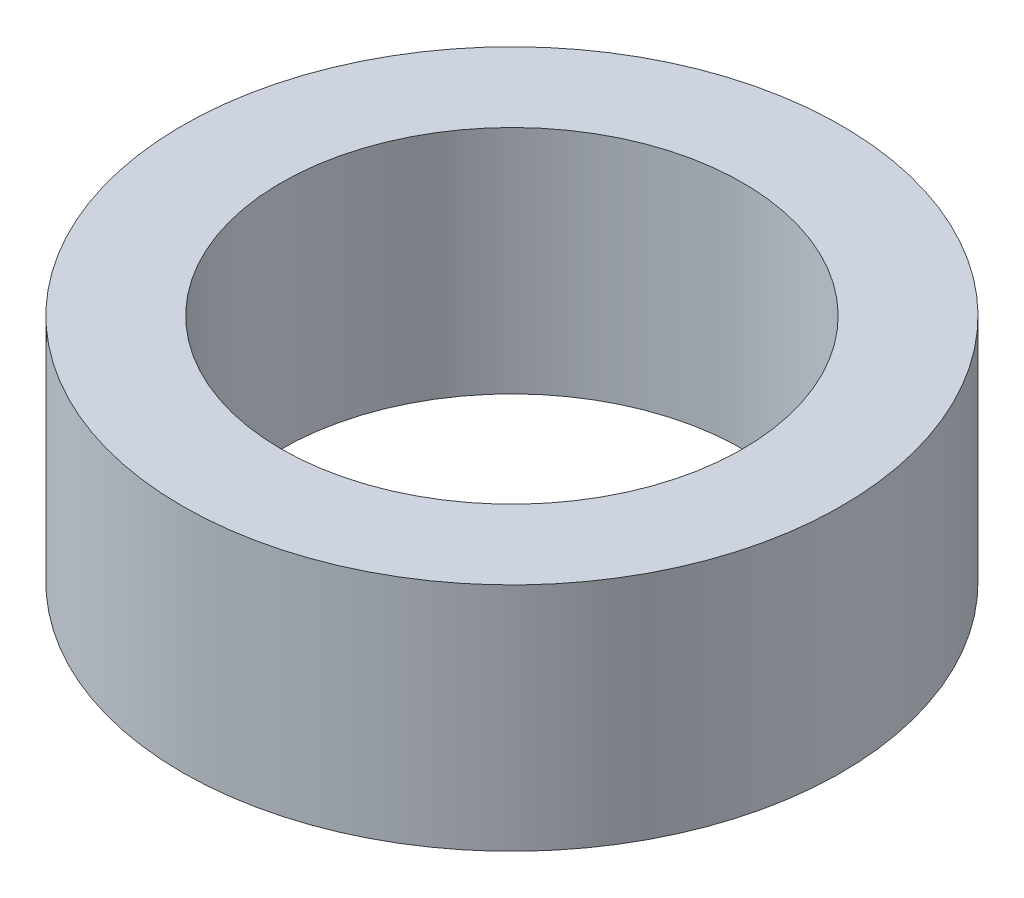
ISO-10303-21;
HEADER;
FILE_DESCRIPTION(('STEP AP214'),'2;1');
FILE_NAME('part.step','',(''),(''),'','','');
FILE_SCHEMA(('AUTOMOTIVE_DESIGN { 1 0 10303 214 1 1 1 1 }'));
ENDSEC;
DATA;
#1=APPLICATION_CONTEXT('core data for automotive mechanical design processes');
#2=APPLICATION_PROTOCOL_DEFINITION('international standard','automotive_design',2000,#1);
#3=PRODUCT_CONTEXT('',#1,'mechanical');
#4=PRODUCT('Part','Part','',(#3));
#5=PRODUCT_RELATED_PRODUCT_CATEGORY('part','',(#4));
#6=PRODUCT_DEFINITION_FORMATION('','',#4);
#7=PRODUCT_DEFINITION_CONTEXT('part definition',#1,'design');
#8=PRODUCT_DEFINITION('design','',#6,#7);
#9=PRODUCT_DEFINITION_SHAPE('','',#8);
#10=(LENGTH_UNIT() NAMED_UNIT(*) SI_UNIT(.MILLI.,.METRE.));
#11=(NAMED_UNIT(*) PLANE_ANGLE_UNIT() SI_UNIT($,.RADIAN.));
#12=(NAMED_UNIT(*) SI_UNIT($,.STERADIAN.) SOLID_ANGLE_UNIT());
#13=UNCERTAINTY_MEASURE_WITH_UNIT(LENGTH_MEASURE(1.E-05),#10,'distance_accuracy_value','');
#14=(GEOMETRIC_REPRESENTATION_CONTEXT(3) GLOBAL_UNCERTAINTY_ASSIGNED_CONTEXT((#13)) GLOBAL_UNIT_ASSIGNED_CONTEXT((#10,
#11,#12)) REPRESENTATION_CONTEXT('',''));
#15=CARTESIAN_POINT('',(0.,0.,0.));
#16=DIRECTION('',(0.,0.,1.));
#17=DIRECTION('',(1.,0.,0.));
#18=AXIS2_PLACEMENT_3D('',#15,#16,#17);
#19=CARTESIAN_POINT('',(0.,8.89,0.));
#20=DIRECTION('',(0.,1.,0.));
#21=DIRECTION('',(0.,0.,1.));
#22=AXIS2_PLACEMENT_3D('',#19,#20,#21);
#23=PLANE('',#22);
#24=CARTESIAN_POINT('',(0.,8.89,0.));
#25=DIRECTION('',(0.,1.,0.));
#26=DIRECTION('',(0.,0.,1.));
#27=AXIS2_PLACEMENT_3D('',#24,#25,#26);
#28=CIRCLE('',#27,12.7);
#29=CARTESIAN_POINT('',(0.,8.89,12.7));
#30=VERTEX_POINT('',#29);
#31=EDGE_CURVE('E10',#30,#30,#28,.T.);
#32=ORIENTED_EDGE('',*,*,#31,.T.);
#33=EDGE_LOOP('',(#32));
#34=FACE_BOUND('',#33,.T.);
#35=CARTESIAN_POINT('',(0.,8.89,0.));
#36=DIRECTION('',(0.,1.,0.));
#37=DIRECTION('',(0.,0.,1.));
#38=AXIS2_PLACEMENT_3D('',#35,#36,#37);
#39=CIRCLE('',#38,8.89);
#40=CARTESIAN_POINT('',(0.,8.89,8.89));
#41=VERTEX_POINT('',#40);
#42=EDGE_CURVE('E54',#41,#41,#39,.T.);
#43=ORIENTED_EDGE('',*,*,#42,.F.);
#44=EDGE_LOOP('',(#43));
#45=FACE_BOUND('',#44,.T.);
#46=ADVANCED_FACE('F41',(#34,#45),#23,.T.);
#47=CARTESIAN_POINT('',(0.,0.,0.));
#48=DIRECTION('',(0.,1.,0.));
#49=DIRECTION('',(0.,0.,1.));
#50=AXIS2_PLACEMENT_3D('',#47,#48,#49);
#51=PLANE('',#50);
#52=CARTESIAN_POINT('',(0.,0.,0.));
#53=DIRECTION('',(0.,1.,0.));
#54=DIRECTION('',(0.,0.,1.));
#55=AXIS2_PLACEMENT_3D('',#52,#53,#54);
#56=CIRCLE('',#55,12.7);
#57=CARTESIAN_POINT('',(0.,0.,12.7));
#58=VERTEX_POINT('',#57);
#59=EDGE_CURVE('E45',#58,#58,#56,.T.);
#60=ORIENTED_EDGE('',*,*,#59,.F.);
#61=EDGE_LOOP('',(#60));
#62=FACE_BOUND('',#61,.T.);
#63=CARTESIAN_POINT('',(0.,0.,0.));
#64=DIRECTION('',(0.,1.,0.));
#65=DIRECTION('',(0.,0.,1.));
#66=AXIS2_PLACEMENT_3D('',#63,#64,#65);
#67=CIRCLE('',#66,8.89);
#68=CARTESIAN_POINT('',(0.,0.,8.89));
#69=VERTEX_POINT('',#68);
#70=EDGE_CURVE('E56',#69,#69,#67,.T.);
#71=ORIENTED_EDGE('',*,*,#70,.T.);
#72=EDGE_LOOP('',(#71));
#73=FACE_BOUND('',#72,.T.);
#74=ADVANCED_FACE('F68',(#62,#73),#51,.F.);
#75=CARTESIAN_POINT('',(0.,8.89,0.));
#76=DIRECTION('',(0.,-1.,0.));
#77=DIRECTION('',(0.,0.,-1.));
#78=AXIS2_PLACEMENT_3D('',#75,#76,#77);
#79=CYLINDRICAL_SURFACE('',#78,12.7);
#80=ORIENTED_EDGE('',*,*,#31,.F.);
#81=EDGE_LOOP('',(#80));
#82=FACE_BOUND('',#81,.T.);
#83=ORIENTED_EDGE('',*,*,#59,.T.);
#84=EDGE_LOOP('',(#83));
#85=FACE_BOUND('',#84,.T.);
#86=ADVANCED_FACE('F43',(#82,#85),#79,.T.);
#87=CARTESIAN_POINT('',(0.,8.89,0.));
#88=DIRECTION('',(0.,-1.,0.));
#89=DIRECTION('',(0.,0.,-1.));
#90=AXIS2_PLACEMENT_3D('',#87,#88,#89);
#91=CYLINDRICAL_SURFACE('',#90,8.89);
#92=ORIENTED_EDGE('',*,*,#42,.T.);
#93=EDGE_LOOP('',(#92));
#94=FACE_BOUND('',#93,.T.);
#95=ORIENTED_EDGE('',*,*,#70,.F.);
#96=EDGE_LOOP('',(#95));
#97=FACE_BOUND('',#96,.T.);
#98=ADVANCED_FACE('F64',(#94,#97),#91,.F.);
#99=CLOSED_SHELL('',(#46,#74,#86,#98));
#100=MANIFOLD_SOLID_BREP('B2',#99);
#101=ADVANCED_BREP_SHAPE_REPRESENTATION('',(#18,#100),#14);
#102=SHAPE_DEFINITION_REPRESENTATION(#9,#101);
ENDSEC;
END-ISO-10303-21;
